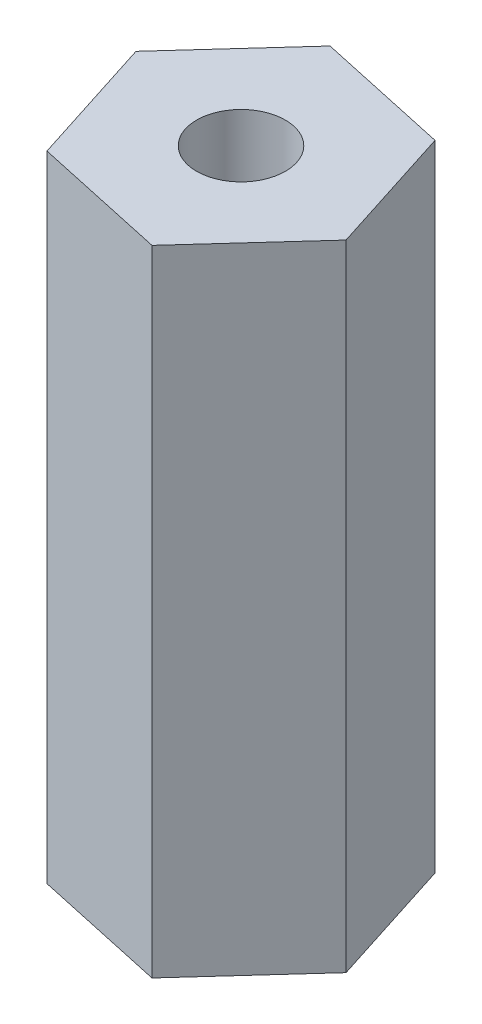
ISO-10303-21;
HEADER;
FILE_DESCRIPTION(('STEP AP214'),'2;1');
FILE_NAME('part.step','',(''),(''),'','','');
FILE_SCHEMA(('AUTOMOTIVE_DESIGN { 1 0 10303 214 1 1 1 1 }'));
ENDSEC;
DATA;
#1=APPLICATION_CONTEXT('core data for automotive mechanical design processes');
#2=APPLICATION_PROTOCOL_DEFINITION('international standard','automotive_design',2000,#1);
#3=PRODUCT_CONTEXT('',#1,'mechanical');
#4=PRODUCT('Part','Part','',(#3));
#5=PRODUCT_RELATED_PRODUCT_CATEGORY('part','',(#4));
#6=PRODUCT_DEFINITION_FORMATION('','',#4);
#7=PRODUCT_DEFINITION_CONTEXT('part definition',#1,'design');
#8=PRODUCT_DEFINITION('design','',#6,#7);
#9=PRODUCT_DEFINITION_SHAPE('','',#8);
#10=(LENGTH_UNIT() NAMED_UNIT(*) SI_UNIT(.MILLI.,.METRE.));
#11=(NAMED_UNIT(*) PLANE_ANGLE_UNIT() SI_UNIT($,.RADIAN.));
#12=(NAMED_UNIT(*) SI_UNIT($,.STERADIAN.) SOLID_ANGLE_UNIT());
#13=UNCERTAINTY_MEASURE_WITH_UNIT(LENGTH_MEASURE(1.E-05),#10,'distance_accuracy_value','');
#14=(GEOMETRIC_REPRESENTATION_CONTEXT(3) GLOBAL_UNCERTAINTY_ASSIGNED_CONTEXT((#13)) GLOBAL_UNIT_ASSIGNED_CONTEXT((#10,
#11,#12)) REPRESENTATION_CONTEXT('',''));
#15=CARTESIAN_POINT('',(0.,0.,0.));
#16=DIRECTION('',(0.,0.,1.));
#17=DIRECTION('',(1.,0.,0.));
#18=AXIS2_PLACEMENT_3D('',#15,#16,#17);
#19=CARTESIAN_POINT('',(2.68678316803039,12.7,0.584521135621778));
#20=DIRECTION('',(-0.952521764733433,0.,0.304470503840858));
#21=DIRECTION('',(0.304470503840858,0.,0.952521764733433));
#22=AXIS2_PLACEMENT_3D('',#19,#20,#21);
#23=PLANE('',#22);
#24=DIRECTION('',(-0.304470503840858,0.,-0.952521764733433));
#25=VECTOR('',#24,1.);
#26=CARTESIAN_POINT('',(2.68678316803039,0.,0.584521135621778));
#27=LINE('',#26,#25);
#28=CARTESIAN_POINT('',(2.68678316803039,0.,0.584521135621778));
#29=VERTEX_POINT('',#28);
#30=CARTESIAN_POINT('',(1.84960173651259,0.,-2.03456191016386));
#31=VERTEX_POINT('',#30);
#32=EDGE_CURVE('E121',#29,#31,#27,.T.);
#33=ORIENTED_EDGE('',*,*,#32,.T.);
#34=DIRECTION('',(0.,-1.,0.));
#35=VECTOR('',#34,1.);
#36=CARTESIAN_POINT('',(1.84960173651259,12.7,-2.03456191016386));
#37=LINE('',#36,#35);
#38=CARTESIAN_POINT('',(1.84960173651259,12.7,-2.03456191016386));
#39=VERTEX_POINT('',#38);
#40=EDGE_CURVE('E11',#39,#31,#37,.T.);
#41=ORIENTED_EDGE('',*,*,#40,.F.);
#42=DIRECTION('',(-0.304470503840858,0.,-0.952521764733433));
#43=VECTOR('',#42,1.);
#44=CARTESIAN_POINT('',(2.68678316803039,12.7,0.584521135621778));
#45=LINE('',#44,#43);
#46=CARTESIAN_POINT('',(2.68678316803039,12.7,0.584521135621778));
#47=VERTEX_POINT('',#46);
#48=EDGE_CURVE('E132',#47,#39,#45,.T.);
#49=ORIENTED_EDGE('',*,*,#48,.F.);
#50=DIRECTION('',(0.,-1.,0.));
#51=VECTOR('',#50,1.);
#52=CARTESIAN_POINT('',(2.68678316803039,12.7,0.584521135621778));
#53=LINE('',#52,#51);
#54=EDGE_CURVE('E117',#47,#29,#53,.T.);
#55=ORIENTED_EDGE('',*,*,#54,.T.);
#56=EDGE_LOOP('',(#33,#41,#49,#55));
#57=FACE_BOUND('',#56,.T.);
#58=ADVANCED_FACE('F37',(#57),#23,.F.);
#59=CARTESIAN_POINT('',(1.84960173651259,12.7,-2.03456191016386));
#60=DIRECTION('',(-0.212581691337486,0.,0.977143297837167));
#61=DIRECTION('',(0.977143297837167,0.,0.212581691337486));
#62=AXIS2_PLACEMENT_3D('',#59,#60,#61);
#63=PLANE('',#62);
#64=DIRECTION('',(-0.977143297837167,0.,-0.212581691337486));
#65=VECTOR('',#64,1.);
#66=CARTESIAN_POINT('',(1.84960173651259,0.,-2.03456191016386));
#67=LINE('',#66,#65);
#68=CARTESIAN_POINT('',(-0.837181431517807,0.,-2.61908304578564));
#69=VERTEX_POINT('',#68);
#70=EDGE_CURVE('E124',#31,#69,#67,.T.);
#71=ORIENTED_EDGE('',*,*,#70,.T.);
#72=DIRECTION('',(0.,-1.,0.));
#73=VECTOR('',#72,1.);
#74=CARTESIAN_POINT('',(-0.837181431517807,12.7,-2.61908304578564));
#75=LINE('',#74,#73);
#76=CARTESIAN_POINT('',(-0.837181431517807,12.7,-2.61908304578564));
#77=VERTEX_POINT('',#76);
#78=EDGE_CURVE('E45',#77,#69,#75,.T.);
#79=ORIENTED_EDGE('',*,*,#78,.F.);
#80=DIRECTION('',(-0.977143297837167,0.,-0.212581691337486));
#81=VECTOR('',#80,1.);
#82=CARTESIAN_POINT('',(1.84960173651259,12.7,-2.03456191016386));
#83=LINE('',#82,#81);
#84=EDGE_CURVE('E90',#39,#77,#83,.T.);
#85=ORIENTED_EDGE('',*,*,#84,.F.);
#86=ORIENTED_EDGE('',*,*,#40,.T.);
#87=EDGE_LOOP('',(#71,#79,#85,#86));
#88=FACE_BOUND('',#87,.T.);
#89=ADVANCED_FACE('F157',(#88),#63,.F.);
#90=CARTESIAN_POINT('',(-0.837181431517807,12.7,-2.61908304578564));
#91=DIRECTION('',(0.739940073395947,0.,0.672672793996308));
#92=DIRECTION('',(0.672672793996308,0.,-0.739940073395947));
#93=AXIS2_PLACEMENT_3D('',#90,#91,#92);
#94=PLANE('',#93);
#95=DIRECTION('',(-0.672672793996308,0.,0.739940073395947));
#96=VECTOR('',#95,1.);
#97=CARTESIAN_POINT('',(-0.837181431517807,0.,-2.61908304578564));
#98=LINE('',#97,#96);
#99=CARTESIAN_POINT('',(-2.68678316803039,0.,-0.584521135621777));
#100=VERTEX_POINT('',#99);
#101=EDGE_CURVE('E127',#69,#100,#98,.T.);
#102=ORIENTED_EDGE('',*,*,#101,.T.);
#103=DIRECTION('',(0.,-1.,0.));
#104=VECTOR('',#103,1.);
#105=CARTESIAN_POINT('',(-2.68678316803039,12.7,-0.584521135621777));
#106=LINE('',#105,#104);
#107=CARTESIAN_POINT('',(-2.68678316803039,12.7,-0.584521135621777));
#108=VERTEX_POINT('',#107);
#109=EDGE_CURVE('E112',#108,#100,#106,.T.);
#110=ORIENTED_EDGE('',*,*,#109,.F.);
#111=DIRECTION('',(-0.672672793996308,0.,0.739940073395947));
#112=VECTOR('',#111,1.);
#113=CARTESIAN_POINT('',(-0.837181431517807,12.7,-2.61908304578564));
#114=LINE('',#113,#112);
#115=EDGE_CURVE('E103',#77,#108,#114,.T.);
#116=ORIENTED_EDGE('',*,*,#115,.F.);
#117=ORIENTED_EDGE('',*,*,#78,.T.);
#118=EDGE_LOOP('',(#102,#110,#116,#117));
#119=FACE_BOUND('',#118,.T.);
#120=ADVANCED_FACE('F138',(#119),#94,.F.);
#121=CARTESIAN_POINT('',(-2.68678316803039,12.7,-0.584521135621777));
#122=DIRECTION('',(0.952521764733433,0.,-0.304470503840858));
#123=DIRECTION('',(-0.304470503840858,0.,-0.952521764733433));
#124=AXIS2_PLACEMENT_3D('',#121,#122,#123);
#125=PLANE('',#124);
#126=DIRECTION('',(0.304470503840858,0.,0.952521764733433));
#127=VECTOR('',#126,1.);
#128=CARTESIAN_POINT('',(-2.68678316803039,0.,-0.584521135621777));
#129=LINE('',#128,#127);
#130=CARTESIAN_POINT('',(-1.84960173651258,0.,2.03456191016386));
#131=VERTEX_POINT('',#130);
#132=EDGE_CURVE('E111',#100,#131,#129,.T.);
#133=ORIENTED_EDGE('',*,*,#132,.T.);
#134=DIRECTION('',(0.,-1.,0.));
#135=VECTOR('',#134,1.);
#136=CARTESIAN_POINT('',(-1.84960173651258,12.7,2.03456191016386));
#137=LINE('',#136,#135);
#138=CARTESIAN_POINT('',(-1.84960173651258,12.7,2.03456191016386));
#139=VERTEX_POINT('',#138);
#140=EDGE_CURVE('E108',#139,#131,#137,.T.);
#141=ORIENTED_EDGE('',*,*,#140,.F.);
#142=DIRECTION('',(0.304470503840858,0.,0.952521764733433));
#143=VECTOR('',#142,1.);
#144=CARTESIAN_POINT('',(-2.68678316803039,12.7,-0.584521135621777));
#145=LINE('',#144,#143);
#146=EDGE_CURVE('E97',#108,#139,#145,.T.);
#147=ORIENTED_EDGE('',*,*,#146,.F.);
#148=ORIENTED_EDGE('',*,*,#109,.T.);
#149=EDGE_LOOP('',(#133,#141,#147,#148));
#150=FACE_BOUND('',#149,.T.);
#151=ADVANCED_FACE('F109',(#150),#125,.F.);
#152=CARTESIAN_POINT('',(-1.84960173651258,12.7,2.03456191016386));
#153=DIRECTION('',(0.212581691337486,0.,-0.977143297837167));
#154=DIRECTION('',(-0.977143297837167,0.,-0.212581691337486));
#155=AXIS2_PLACEMENT_3D('',#152,#153,#154);
#156=PLANE('',#155);
#157=DIRECTION('',(0.977143297837167,0.,0.212581691337486));
#158=VECTOR('',#157,1.);
#159=CARTESIAN_POINT('',(-1.84960173651258,0.,2.03456191016386));
#160=LINE('',#159,#158);
#161=CARTESIAN_POINT('',(0.837181431517807,0.,2.61908304578564));
#162=VERTEX_POINT('',#161);
#163=EDGE_CURVE('E76',#131,#162,#160,.T.);
#164=ORIENTED_EDGE('',*,*,#163,.T.);
#165=DIRECTION('',(0.,-1.,0.));
#166=VECTOR('',#165,1.);
#167=CARTESIAN_POINT('',(0.837181431517807,12.7,2.61908304578564));
#168=LINE('',#167,#166);
#169=CARTESIAN_POINT('',(0.837181431517807,12.7,2.61908304578564));
#170=VERTEX_POINT('',#169);
#171=EDGE_CURVE('E113',#170,#162,#168,.T.);
#172=ORIENTED_EDGE('',*,*,#171,.F.);
#173=DIRECTION('',(0.977143297837167,0.,0.212581691337486));
#174=VECTOR('',#173,1.);
#175=CARTESIAN_POINT('',(-1.84960173651258,12.7,2.03456191016386));
#176=LINE('',#175,#174);
#177=EDGE_CURVE('E101',#139,#170,#176,.T.);
#178=ORIENTED_EDGE('',*,*,#177,.F.);
#179=ORIENTED_EDGE('',*,*,#140,.T.);
#180=EDGE_LOOP('',(#164,#172,#178,#179));
#181=FACE_BOUND('',#180,.T.);
#182=ADVANCED_FACE('F115',(#181),#156,.F.);
#183=CARTESIAN_POINT('',(0.837181431517807,12.7,2.61908304578564));
#184=DIRECTION('',(-0.739940073395947,0.,-0.672672793996309));
#185=DIRECTION('',(-0.672672793996309,0.,0.739940073395947));
#186=AXIS2_PLACEMENT_3D('',#183,#184,#185);
#187=PLANE('',#186);
#188=DIRECTION('',(0.672672793996309,0.,-0.739940073395947));
#189=VECTOR('',#188,1.);
#190=CARTESIAN_POINT('',(0.837181431517807,0.,2.61908304578564));
#191=LINE('',#190,#189);
#192=EDGE_CURVE('E82',#162,#29,#191,.T.);
#193=ORIENTED_EDGE('',*,*,#192,.T.);
#194=ORIENTED_EDGE('',*,*,#54,.F.);
#195=DIRECTION('',(0.672672793996309,0.,-0.739940073395947));
#196=VECTOR('',#195,1.);
#197=CARTESIAN_POINT('',(0.837181431517807,12.7,2.61908304578564));
#198=LINE('',#197,#196);
#199=EDGE_CURVE('E53',#170,#47,#198,.T.);
#200=ORIENTED_EDGE('',*,*,#199,.F.);
#201=ORIENTED_EDGE('',*,*,#171,.T.);
#202=EDGE_LOOP('',(#193,#194,#200,#201));
#203=FACE_BOUND('',#202,.T.);
#204=ADVANCED_FACE('F145',(#203),#187,.F.);
#205=CARTESIAN_POINT('',(0.,12.7,0.));
#206=DIRECTION('',(0.,1.,0.));
#207=DIRECTION('',(0.,0.,1.));
#208=AXIS2_PLACEMENT_3D('',#205,#206,#207);
#209=PLANE('',#208);
#210=CARTESIAN_POINT('',(0.,12.7,0.));
#211=DIRECTION('',(0.,1.,0.));
#212=DIRECTION('',(0.,0.,1.));
#213=AXIS2_PLACEMENT_3D('',#210,#211,#212);
#214=CIRCLE('',#213,0.888999999999998);
#215=CARTESIAN_POINT('',(0.,12.7,0.888999999999998));
#216=VERTEX_POINT('',#215);
#217=EDGE_CURVE('E244',#216,#216,#214,.T.);
#218=ORIENTED_EDGE('',*,*,#217,.F.);
#219=EDGE_LOOP('',(#218));
#220=FACE_BOUND('',#219,.T.);
#221=ORIENTED_EDGE('',*,*,#48,.T.);
#222=ORIENTED_EDGE('',*,*,#84,.T.);
#223=ORIENTED_EDGE('',*,*,#115,.T.);
#224=ORIENTED_EDGE('',*,*,#146,.T.);
#225=ORIENTED_EDGE('',*,*,#177,.T.);
#226=ORIENTED_EDGE('',*,*,#199,.T.);
#227=EDGE_LOOP('',(#221,#222,#223,#224,#225,#226));
#228=FACE_BOUND('',#227,.T.);
#229=ADVANCED_FACE('F99',(#220,#228),#209,.T.);
#230=CARTESIAN_POINT('',(0.,0.,0.));
#231=DIRECTION('',(0.,1.,0.));
#232=DIRECTION('',(0.,0.,1.));
#233=AXIS2_PLACEMENT_3D('',#230,#231,#232);
#234=PLANE('',#233);
#235=CARTESIAN_POINT('',(0.,0.,0.));
#236=DIRECTION('',(0.,1.,0.));
#237=DIRECTION('',(0.,0.,1.));
#238=AXIS2_PLACEMENT_3D('',#235,#236,#237);
#239=CIRCLE('',#238,0.888999999999997);
#240=CARTESIAN_POINT('',(0.,0.,0.888999999999997));
#241=VERTEX_POINT('',#240);
#242=EDGE_CURVE('E125',#241,#241,#239,.T.);
#243=ORIENTED_EDGE('',*,*,#242,.T.);
#244=EDGE_LOOP('',(#243));
#245=FACE_BOUND('',#244,.T.);
#246=ORIENTED_EDGE('',*,*,#32,.F.);
#247=ORIENTED_EDGE('',*,*,#192,.F.);
#248=ORIENTED_EDGE('',*,*,#163,.F.);
#249=ORIENTED_EDGE('',*,*,#132,.F.);
#250=ORIENTED_EDGE('',*,*,#101,.F.);
#251=ORIENTED_EDGE('',*,*,#70,.F.);
#252=EDGE_LOOP('',(#246,#247,#248,#249,#250,#251));
#253=FACE_BOUND('',#252,.T.);
#254=ADVANCED_FACE('F141',(#245,#253),#234,.F.);
#255=CARTESIAN_POINT('',(0.,12.7,0.));
#256=DIRECTION('',(0.,1.,0.));
#257=DIRECTION('',(0.,0.,1.));
#258=AXIS2_PLACEMENT_3D('',#255,#256,#257);
#259=CYLINDRICAL_SURFACE('',#258,0.888999999999998);
#260=ORIENTED_EDGE('',*,*,#242,.F.);
#261=EDGE_LOOP('',(#260));
#262=FACE_BOUND('',#261,.T.);
#263=ORIENTED_EDGE('',*,*,#217,.T.);
#264=EDGE_LOOP('',(#263));
#265=FACE_BOUND('',#264,.T.);
#266=ADVANCED_FACE('F194',(#262,#265),#259,.F.);
#267=CLOSED_SHELL('',(#58,#89,#120,#151,#182,#204,#229,#254,#266));
#268=MANIFOLD_SOLID_BREP('B2',#267);
#269=ADVANCED_BREP_SHAPE_REPRESENTATION('',(#18,#268),#14);
#270=SHAPE_DEFINITION_REPRESENTATION(#9,#269);
ENDSEC;
END-ISO-10303-21;
